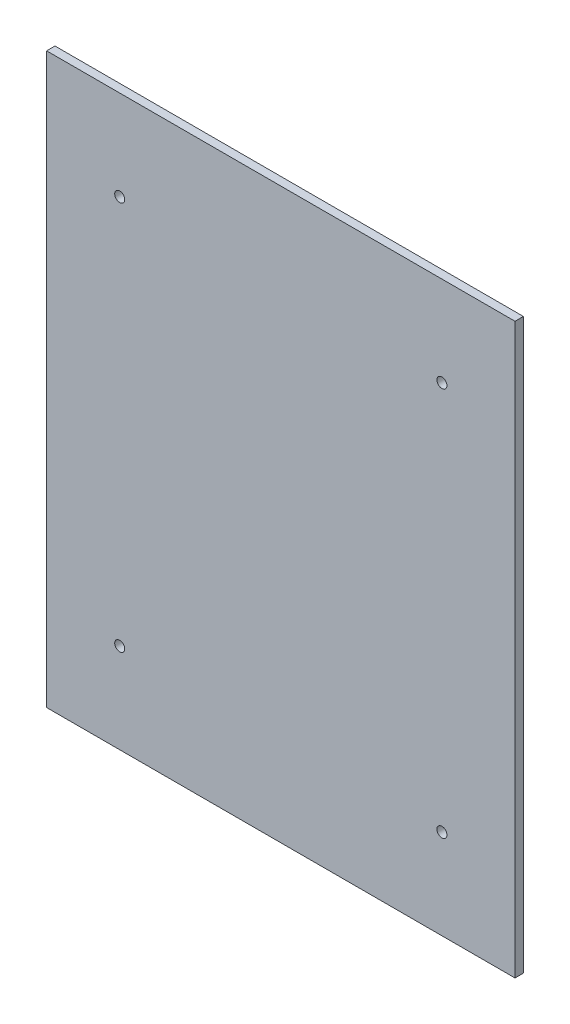
ISO-10303-21;
HEADER;
FILE_DESCRIPTION(('STEP AP214'),'2;1');
FILE_NAME('part.step','',(''),(''),'','','');
FILE_SCHEMA(('AUTOMOTIVE_DESIGN { 1 0 10303 214 1 1 1 1 }'));
ENDSEC;
DATA;
#1=APPLICATION_CONTEXT('core data for automotive mechanical design processes');
#2=APPLICATION_PROTOCOL_DEFINITION('international standard','automotive_design',2000,#1);
#3=PRODUCT_CONTEXT('',#1,'mechanical');
#4=PRODUCT('Part','Part','',(#3));
#5=PRODUCT_RELATED_PRODUCT_CATEGORY('part','',(#4));
#6=PRODUCT_DEFINITION_FORMATION('','',#4);
#7=PRODUCT_DEFINITION_CONTEXT('part definition',#1,'design');
#8=PRODUCT_DEFINITION('design','',#6,#7);
#9=PRODUCT_DEFINITION_SHAPE('','',#8);
#10=(LENGTH_UNIT() NAMED_UNIT(*) SI_UNIT(.MILLI.,.METRE.));
#11=(NAMED_UNIT(*) PLANE_ANGLE_UNIT() SI_UNIT($,.RADIAN.));
#12=(NAMED_UNIT(*) SI_UNIT($,.STERADIAN.) SOLID_ANGLE_UNIT());
#13=UNCERTAINTY_MEASURE_WITH_UNIT(LENGTH_MEASURE(1.E-05),#10,'distance_accuracy_value','');
#14=(GEOMETRIC_REPRESENTATION_CONTEXT(3) GLOBAL_UNCERTAINTY_ASSIGNED_CONTEXT((#13)) GLOBAL_UNIT_ASSIGNED_CONTEXT((#10,
#11,#12)) REPRESENTATION_CONTEXT('',''));
#15=CARTESIAN_POINT('',(0.,0.,0.));
#16=DIRECTION('',(0.,0.,1.));
#17=DIRECTION('',(1.,0.,0.));
#18=AXIS2_PLACEMENT_3D('',#15,#16,#17);
#19=CARTESIAN_POINT('',(5854.7,0.,6.35));
#20=DIRECTION('',(0.,1.,0.));
#21=DIRECTION('',(0.,0.,1.));
#22=AXIS2_PLACEMENT_3D('',#19,#20,#21);
#23=PLANE('',#22);
#24=DIRECTION('',(1.,0.,0.));
#25=VECTOR('',#24,1.);
#26=CARTESIAN_POINT('',(5854.7,0.,0.));
#27=LINE('',#26,#25);
#28=CARTESIAN_POINT('',(5676.9,0.,0.));
#29=VERTEX_POINT('',#28);
#30=CARTESIAN_POINT('',(6032.5,0.,0.));
#31=VERTEX_POINT('',#30);
#32=EDGE_CURVE('E102',#29,#31,#27,.T.);
#33=ORIENTED_EDGE('',*,*,#32,.F.);
#34=DIRECTION('',(0.,0.,-1.));
#35=VECTOR('',#34,1.);
#36=CARTESIAN_POINT('',(5676.9,0.,6.35));
#37=LINE('',#36,#35);
#38=CARTESIAN_POINT('',(5676.9,0.,6.35));
#39=VERTEX_POINT('',#38);
#40=EDGE_CURVE('E9',#39,#29,#37,.T.);
#41=ORIENTED_EDGE('',*,*,#40,.F.);
#42=DIRECTION('',(1.,0.,0.));
#43=VECTOR('',#42,1.);
#44=CARTESIAN_POINT('',(5854.7,0.,6.35));
#45=LINE('',#44,#43);
#46=CARTESIAN_POINT('',(6032.5,0.,6.35));
#47=VERTEX_POINT('',#46);
#48=EDGE_CURVE('E79',#39,#47,#45,.T.);
#49=ORIENTED_EDGE('',*,*,#48,.T.);
#50=DIRECTION('',(0.,0.,-1.));
#51=VECTOR('',#50,1.);
#52=CARTESIAN_POINT('',(6032.5,0.,6.35));
#53=LINE('',#52,#51);
#54=EDGE_CURVE('E38',#47,#31,#53,.T.);
#55=ORIENTED_EDGE('',*,*,#54,.T.);
#56=EDGE_LOOP('',(#33,#41,#49,#55));
#57=FACE_BOUND('',#56,.T.);
#58=ADVANCED_FACE('F14',(#57),#23,.T.);
#59=CARTESIAN_POINT('',(5676.9,-215.9,6.35));
#60=DIRECTION('',(1.,0.,0.));
#61=DIRECTION('',(0.,0.,-1.));
#62=AXIS2_PLACEMENT_3D('',#59,#60,#61);
#63=PLANE('',#62);
#64=DIRECTION('',(0.,-1.,0.));
#65=VECTOR('',#64,1.);
#66=CARTESIAN_POINT('',(5676.9,-215.9,0.));
#67=LINE('',#66,#65);
#68=CARTESIAN_POINT('',(5676.9,-431.8,0.));
#69=VERTEX_POINT('',#68);
#70=EDGE_CURVE('E86',#29,#69,#67,.T.);
#71=ORIENTED_EDGE('',*,*,#70,.T.);
#72=DIRECTION('',(0.,0.,-1.));
#73=VECTOR('',#72,1.);
#74=CARTESIAN_POINT('',(5676.9,-431.8,6.35));
#75=LINE('',#74,#73);
#76=CARTESIAN_POINT('',(5676.9,-431.8,6.35));
#77=VERTEX_POINT('',#76);
#78=EDGE_CURVE('E24',#77,#69,#75,.T.);
#79=ORIENTED_EDGE('',*,*,#78,.F.);
#80=DIRECTION('',(0.,-1.,0.));
#81=VECTOR('',#80,1.);
#82=CARTESIAN_POINT('',(5676.9,-215.9,6.35));
#83=LINE('',#82,#81);
#84=EDGE_CURVE('E73',#39,#77,#83,.T.);
#85=ORIENTED_EDGE('',*,*,#84,.F.);
#86=ORIENTED_EDGE('',*,*,#40,.T.);
#87=EDGE_LOOP('',(#71,#79,#85,#86));
#88=FACE_BOUND('',#87,.T.);
#89=ADVANCED_FACE('F84',(#88),#63,.F.);
#90=CARTESIAN_POINT('',(5854.7,-431.8,6.35));
#91=DIRECTION('',(0.,1.,0.));
#92=DIRECTION('',(0.,0.,1.));
#93=AXIS2_PLACEMENT_3D('',#90,#91,#92);
#94=PLANE('',#93);
#95=DIRECTION('',(1.,0.,0.));
#96=VECTOR('',#95,1.);
#97=CARTESIAN_POINT('',(5854.7,-431.8,0.));
#98=LINE('',#97,#96);
#99=CARTESIAN_POINT('',(6032.5,-431.8,0.));
#100=VERTEX_POINT('',#99);
#101=EDGE_CURVE('E107',#69,#100,#98,.T.);
#102=ORIENTED_EDGE('',*,*,#101,.T.);
#103=DIRECTION('',(0.,0.,-1.));
#104=VECTOR('',#103,1.);
#105=CARTESIAN_POINT('',(6032.5,-431.8,6.35));
#106=LINE('',#105,#104);
#107=CARTESIAN_POINT('',(6032.5,-431.8,6.35));
#108=VERTEX_POINT('',#107);
#109=EDGE_CURVE('E57',#108,#100,#106,.T.);
#110=ORIENTED_EDGE('',*,*,#109,.F.);
#111=DIRECTION('',(1.,0.,0.));
#112=VECTOR('',#111,1.);
#113=CARTESIAN_POINT('',(5854.7,-431.8,6.35));
#114=LINE('',#113,#112);
#115=EDGE_CURVE('E78',#77,#108,#114,.T.);
#116=ORIENTED_EDGE('',*,*,#115,.F.);
#117=ORIENTED_EDGE('',*,*,#78,.T.);
#118=EDGE_LOOP('',(#102,#110,#116,#117));
#119=FACE_BOUND('',#118,.T.);
#120=ADVANCED_FACE('F91',(#119),#94,.F.);
#121=CARTESIAN_POINT('',(6032.5,-215.9,6.35));
#122=DIRECTION('',(1.,0.,0.));
#123=DIRECTION('',(0.,0.,-1.));
#124=AXIS2_PLACEMENT_3D('',#121,#122,#123);
#125=PLANE('',#124);
#126=DIRECTION('',(0.,-1.,0.));
#127=VECTOR('',#126,1.);
#128=CARTESIAN_POINT('',(6032.5,-215.9,0.));
#129=LINE('',#128,#127);
#130=EDGE_CURVE('E109',#31,#100,#129,.T.);
#131=ORIENTED_EDGE('',*,*,#130,.F.);
#132=ORIENTED_EDGE('',*,*,#54,.F.);
#133=DIRECTION('',(0.,-1.,0.));
#134=VECTOR('',#133,1.);
#135=CARTESIAN_POINT('',(6032.5,-215.9,6.35));
#136=LINE('',#135,#134);
#137=EDGE_CURVE('E93',#47,#108,#136,.T.);
#138=ORIENTED_EDGE('',*,*,#137,.T.);
#139=ORIENTED_EDGE('',*,*,#109,.T.);
#140=EDGE_LOOP('',(#131,#132,#138,#139));
#141=FACE_BOUND('',#140,.T.);
#142=ADVANCED_FACE('F152',(#141),#125,.T.);
#143=CARTESIAN_POINT('',(5854.7,-215.9,6.35));
#144=DIRECTION('',(0.,0.,1.));
#145=DIRECTION('',(1.,0.,0.));
#146=AXIS2_PLACEMENT_3D('',#143,#144,#145);
#147=PLANE('',#146);
#148=CARTESIAN_POINT('',(5977.001,-363.601,6.35));
#149=DIRECTION('',(0.,0.,1.));
#150=DIRECTION('',(1.,0.,0.));
#151=AXIS2_PLACEMENT_3D('',#148,#149,#150);
#152=CIRCLE('',#151,3.81);
#153=CARTESIAN_POINT('',(5980.811,-363.601,6.35));
#154=VERTEX_POINT('',#153);
#155=EDGE_CURVE('E17',#154,#154,#152,.F.);
#156=ORIENTED_EDGE('',*,*,#155,.T.);
#157=EDGE_LOOP('',(#156));
#158=FACE_BOUND('',#157,.T.);
#159=CARTESIAN_POINT('',(5732.399,-363.601,6.35));
#160=DIRECTION('',(0.,0.,1.));
#161=DIRECTION('',(1.,0.,0.));
#162=AXIS2_PLACEMENT_3D('',#159,#160,#161);
#163=CIRCLE('',#162,3.81);
#164=CARTESIAN_POINT('',(5736.209,-363.601,6.35));
#165=VERTEX_POINT('',#164);
#166=EDGE_CURVE('E125',#165,#165,#163,.F.);
#167=ORIENTED_EDGE('',*,*,#166,.T.);
#168=EDGE_LOOP('',(#167));
#169=FACE_BOUND('',#168,.T.);
#170=CARTESIAN_POINT('',(5732.399,-68.199,6.35));
#171=DIRECTION('',(0.,0.,1.));
#172=DIRECTION('',(1.,0.,0.));
#173=AXIS2_PLACEMENT_3D('',#170,#171,#172);
#174=CIRCLE('',#173,3.81);
#175=CARTESIAN_POINT('',(5736.209,-68.199,6.35));
#176=VERTEX_POINT('',#175);
#177=EDGE_CURVE('E121',#176,#176,#174,.F.);
#178=ORIENTED_EDGE('',*,*,#177,.T.);
#179=EDGE_LOOP('',(#178));
#180=FACE_BOUND('',#179,.T.);
#181=CARTESIAN_POINT('',(5977.001,-68.199,6.35));
#182=DIRECTION('',(0.,0.,1.));
#183=DIRECTION('',(1.,0.,0.));
#184=AXIS2_PLACEMENT_3D('',#181,#182,#183);
#185=CIRCLE('',#184,3.81);
#186=CARTESIAN_POINT('',(5980.811,-68.199,6.35));
#187=VERTEX_POINT('',#186);
#188=EDGE_CURVE('E105',#187,#187,#185,.F.);
#189=ORIENTED_EDGE('',*,*,#188,.T.);
#190=EDGE_LOOP('',(#189));
#191=FACE_BOUND('',#190,.T.);
#192=ORIENTED_EDGE('',*,*,#48,.F.);
#193=ORIENTED_EDGE('',*,*,#84,.T.);
#194=ORIENTED_EDGE('',*,*,#115,.T.);
#195=ORIENTED_EDGE('',*,*,#137,.F.);
#196=EDGE_LOOP('',(#192,#193,#194,#195));
#197=FACE_BOUND('',#196,.T.);
#198=ADVANCED_FACE('F75',(#158,#169,#180,#191,#197),#147,.T.);
#199=CARTESIAN_POINT('',(5854.7,-215.9,0.));
#200=DIRECTION('',(0.,0.,1.));
#201=DIRECTION('',(1.,0.,0.));
#202=AXIS2_PLACEMENT_3D('',#199,#200,#201);
#203=PLANE('',#202);
#204=CARTESIAN_POINT('',(5977.001,-363.601,0.));
#205=DIRECTION('',(0.,0.,-1.));
#206=DIRECTION('',(-1.,0.,0.));
#207=AXIS2_PLACEMENT_3D('',#204,#205,#206);
#208=CIRCLE('',#207,3.81);
#209=CARTESIAN_POINT('',(5973.191,-363.601,0.));
#210=VERTEX_POINT('',#209);
#211=EDGE_CURVE('E145',#210,#210,#208,.T.);
#212=ORIENTED_EDGE('',*,*,#211,.F.);
#213=EDGE_LOOP('',(#212));
#214=FACE_BOUND('',#213,.T.);
#215=CARTESIAN_POINT('',(5732.399,-363.601,0.));
#216=DIRECTION('',(0.,0.,-1.));
#217=DIRECTION('',(-1.,0.,0.));
#218=AXIS2_PLACEMENT_3D('',#215,#216,#217);
#219=CIRCLE('',#218,3.81);
#220=CARTESIAN_POINT('',(5728.589,-363.601,0.));
#221=VERTEX_POINT('',#220);
#222=EDGE_CURVE('E128',#221,#221,#219,.T.);
#223=ORIENTED_EDGE('',*,*,#222,.F.);
#224=EDGE_LOOP('',(#223));
#225=FACE_BOUND('',#224,.T.);
#226=CARTESIAN_POINT('',(5732.399,-68.199,0.));
#227=DIRECTION('',(0.,0.,-1.));
#228=DIRECTION('',(-1.,0.,0.));
#229=AXIS2_PLACEMENT_3D('',#226,#227,#228);
#230=CIRCLE('',#229,3.81);
#231=CARTESIAN_POINT('',(5728.589,-68.199,0.));
#232=VERTEX_POINT('',#231);
#233=EDGE_CURVE('E124',#232,#232,#230,.T.);
#234=ORIENTED_EDGE('',*,*,#233,.F.);
#235=EDGE_LOOP('',(#234));
#236=FACE_BOUND('',#235,.T.);
#237=CARTESIAN_POINT('',(5977.001,-68.199,0.));
#238=DIRECTION('',(0.,0.,-1.));
#239=DIRECTION('',(-1.,0.,0.));
#240=AXIS2_PLACEMENT_3D('',#237,#238,#239);
#241=CIRCLE('',#240,3.81);
#242=CARTESIAN_POINT('',(5973.191,-68.199,0.));
#243=VERTEX_POINT('',#242);
#244=EDGE_CURVE('E120',#243,#243,#241,.T.);
#245=ORIENTED_EDGE('',*,*,#244,.F.);
#246=EDGE_LOOP('',(#245));
#247=FACE_BOUND('',#246,.T.);
#248=ORIENTED_EDGE('',*,*,#32,.T.);
#249=ORIENTED_EDGE('',*,*,#130,.T.);
#250=ORIENTED_EDGE('',*,*,#101,.F.);
#251=ORIENTED_EDGE('',*,*,#70,.F.);
#252=EDGE_LOOP('',(#248,#249,#250,#251));
#253=FACE_BOUND('',#252,.T.);
#254=ADVANCED_FACE('F160',(#214,#225,#236,#247,#253),#203,.F.);
#255=CARTESIAN_POINT('',(5977.001,-68.199,560.557655505868));
#256=DIRECTION('',(0.,0.,-1.));
#257=DIRECTION('',(-1.,0.,0.));
#258=AXIS2_PLACEMENT_3D('',#255,#256,#257);
#259=CYLINDRICAL_SURFACE('',#258,3.81);
#260=ORIENTED_EDGE('',*,*,#188,.F.);
#261=EDGE_LOOP('',(#260));
#262=FACE_BOUND('',#261,.T.);
#263=ORIENTED_EDGE('',*,*,#244,.T.);
#264=EDGE_LOOP('',(#263));
#265=FACE_BOUND('',#264,.T.);
#266=ADVANCED_FACE('F202',(#262,#265),#259,.F.);
#267=CARTESIAN_POINT('',(5732.399,-68.199,560.557655505868));
#268=DIRECTION('',(0.,0.,-1.));
#269=DIRECTION('',(-1.,0.,0.));
#270=AXIS2_PLACEMENT_3D('',#267,#268,#269);
#271=CYLINDRICAL_SURFACE('',#270,3.81);
#272=ORIENTED_EDGE('',*,*,#177,.F.);
#273=EDGE_LOOP('',(#272));
#274=FACE_BOUND('',#273,.T.);
#275=ORIENTED_EDGE('',*,*,#233,.T.);
#276=EDGE_LOOP('',(#275));
#277=FACE_BOUND('',#276,.T.);
#278=ADVANCED_FACE('F212',(#274,#277),#271,.F.);
#279=CARTESIAN_POINT('',(5732.399,-363.601,560.557655505868));
#280=DIRECTION('',(0.,0.,-1.));
#281=DIRECTION('',(-1.,0.,0.));
#282=AXIS2_PLACEMENT_3D('',#279,#280,#281);
#283=CYLINDRICAL_SURFACE('',#282,3.81);
#284=ORIENTED_EDGE('',*,*,#166,.F.);
#285=EDGE_LOOP('',(#284));
#286=FACE_BOUND('',#285,.T.);
#287=ORIENTED_EDGE('',*,*,#222,.T.);
#288=EDGE_LOOP('',(#287));
#289=FACE_BOUND('',#288,.T.);
#290=ADVANCED_FACE('F223',(#286,#289),#283,.F.);
#291=CARTESIAN_POINT('',(5977.001,-363.601,560.557655505868));
#292=DIRECTION('',(0.,0.,-1.));
#293=DIRECTION('',(-1.,0.,0.));
#294=AXIS2_PLACEMENT_3D('',#291,#292,#293);
#295=CYLINDRICAL_SURFACE('',#294,3.81);
#296=ORIENTED_EDGE('',*,*,#155,.F.);
#297=EDGE_LOOP('',(#296));
#298=FACE_BOUND('',#297,.T.);
#299=ORIENTED_EDGE('',*,*,#211,.T.);
#300=EDGE_LOOP('',(#299));
#301=FACE_BOUND('',#300,.T.);
#302=ADVANCED_FACE('F233',(#298,#301),#295,.F.);
#303=CLOSED_SHELL('',(#58,#89,#120,#142,#198,#254,#266,#278,#290,#302));
#304=MANIFOLD_SOLID_BREP('B1',#303);
#305=ADVANCED_BREP_SHAPE_REPRESENTATION('',(#18,#304),#14);
#306=SHAPE_DEFINITION_REPRESENTATION(#9,#305);
ENDSEC;
END-ISO-10303-21;
